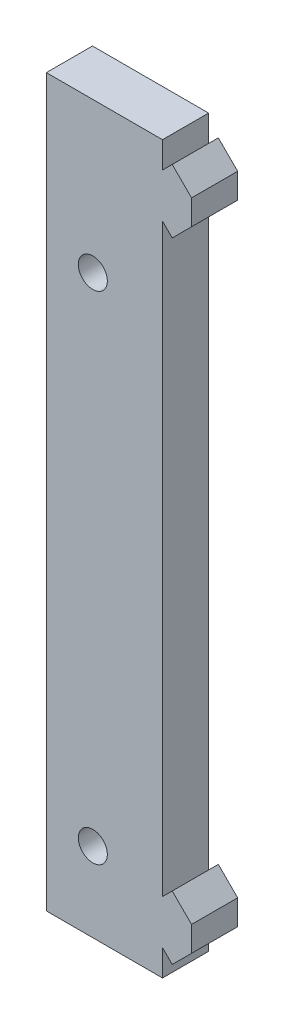
ISO-10303-21;
HEADER;
FILE_DESCRIPTION(('STEP AP214'),'2;1');
FILE_NAME('part.step','',(''),(''),'','','');
FILE_SCHEMA(('AUTOMOTIVE_DESIGN { 1 0 10303 214 1 1 1 1 }'));
ENDSEC;
DATA;
#1=APPLICATION_CONTEXT('core data for automotive mechanical design processes');
#2=APPLICATION_PROTOCOL_DEFINITION('international standard','automotive_design',2000,#1);
#3=PRODUCT_CONTEXT('',#1,'mechanical');
#4=PRODUCT('Part','Part','',(#3));
#5=PRODUCT_RELATED_PRODUCT_CATEGORY('part','',(#4));
#6=PRODUCT_DEFINITION_FORMATION('','',#4);
#7=PRODUCT_DEFINITION_CONTEXT('part definition',#1,'design');
#8=PRODUCT_DEFINITION('design','',#6,#7);
#9=PRODUCT_DEFINITION_SHAPE('','',#8);
#10=(LENGTH_UNIT() NAMED_UNIT(*) SI_UNIT(.MILLI.,.METRE.));
#11=(NAMED_UNIT(*) PLANE_ANGLE_UNIT() SI_UNIT($,.RADIAN.));
#12=(NAMED_UNIT(*) SI_UNIT($,.STERADIAN.) SOLID_ANGLE_UNIT());
#13=UNCERTAINTY_MEASURE_WITH_UNIT(LENGTH_MEASURE(1.E-05),#10,'distance_accuracy_value','');
#14=(GEOMETRIC_REPRESENTATION_CONTEXT(3) GLOBAL_UNCERTAINTY_ASSIGNED_CONTEXT((#13)) GLOBAL_UNIT_ASSIGNED_CONTEXT((#10,
#11,#12)) REPRESENTATION_CONTEXT('',''));
#15=CARTESIAN_POINT('',(0.,0.,0.));
#16=DIRECTION('',(0.,0.,1.));
#17=DIRECTION('',(1.,0.,0.));
#18=AXIS2_PLACEMENT_3D('',#15,#16,#17);
#19=CARTESIAN_POINT('',(0.,0.,4.7625));
#20=DIRECTION('',(0.,0.,-1.));
#21=DIRECTION('',(-1.,0.,0.));
#22=AXIS2_PLACEMENT_3D('',#19,#20,#21);
#23=PLANE('',#22);
#24=CARTESIAN_POINT('',(-7.2,-15.5,4.7625));
#25=DIRECTION('',(0.,0.,1.));
#26=DIRECTION('',(1.,0.,0.));
#27=AXIS2_PLACEMENT_3D('',#24,#25,#26);
#28=CIRCLE('',#27,1.5);
#29=CARTESIAN_POINT('',(-5.7,-15.5,4.7625));
#30=VERTEX_POINT('',#29);
#31=EDGE_CURVE('E180',#30,#30,#28,.T.);
#32=ORIENTED_EDGE('',*,*,#31,.F.);
#33=EDGE_LOOP('',(#32));
#34=FACE_BOUND('',#33,.T.);
#35=DIRECTION('',(0.,1.,0.));
#36=VECTOR('',#35,1.);
#37=CARTESIAN_POINT('',(0.,-2.71680015377856,4.7625));
#38=LINE('',#37,#36);
#39=CARTESIAN_POINT('',(0.,-2.71680015377856,4.7625));
#40=VERTEX_POINT('',#39);
#41=CARTESIAN_POINT('',(0.,0.,4.7625));
#42=VERTEX_POINT('',#41);
#43=EDGE_CURVE('E207',#40,#42,#38,.T.);
#44=ORIENTED_EDGE('',*,*,#43,.T.);
#45=DIRECTION('',(-1.,0.,0.));
#46=VECTOR('',#45,1.);
#47=CARTESIAN_POINT('',(-12.,0.,4.7625));
#48=LINE('',#47,#46);
#49=CARTESIAN_POINT('',(-12.,0.,4.7625));
#50=VERTEX_POINT('',#49);
#51=EDGE_CURVE('E115',#42,#50,#48,.T.);
#52=ORIENTED_EDGE('',*,*,#51,.T.);
#53=DIRECTION('',(0.,-1.,0.));
#54=VECTOR('',#53,1.);
#55=CARTESIAN_POINT('',(-12.,-75.,4.7625));
#56=LINE('',#55,#54);
#57=CARTESIAN_POINT('',(-12.,-75.,4.7625));
#58=VERTEX_POINT('',#57);
#59=EDGE_CURVE('E246',#50,#58,#56,.T.);
#60=ORIENTED_EDGE('',*,*,#59,.T.);
#61=DIRECTION('',(1.,0.,0.));
#62=VECTOR('',#61,1.);
#63=CARTESIAN_POINT('',(-12.,-75.,4.7625));
#64=LINE('',#63,#62);
#65=CARTESIAN_POINT('',(0.,-75.,4.7625));
#66=VERTEX_POINT('',#65);
#67=EDGE_CURVE('E265',#58,#66,#64,.T.);
#68=ORIENTED_EDGE('',*,*,#67,.T.);
#69=DIRECTION('',(0.,1.,0.));
#70=VECTOR('',#69,1.);
#71=CARTESIAN_POINT('',(0.,-75.,4.7625));
#72=LINE('',#71,#70);
#73=CARTESIAN_POINT('',(0.,-72.2831998462214,4.7625));
#74=VERTEX_POINT('',#73);
#75=EDGE_CURVE('E262',#66,#74,#72,.T.);
#76=ORIENTED_EDGE('',*,*,#75,.T.);
#77=DIRECTION('',(0.707106781186546,-0.707106781186549,0.));
#78=VECTOR('',#77,1.);
#79=CARTESIAN_POINT('',(0.,-72.2831998462214,4.7625));
#80=LINE('',#79,#78);
#81=CARTESIAN_POINT('',(1.00484668629601,-73.2880465325174,4.7625));
#82=VERTEX_POINT('',#81);
#83=EDGE_CURVE('E264',#74,#82,#80,.T.);
#84=ORIENTED_EDGE('',*,*,#83,.T.);
#85=DIRECTION('',(0.707106781186543,0.707106781186552,0.));
#86=VECTOR('',#85,1.);
#87=CARTESIAN_POINT('',(1.00484668629601,-73.2880465325174,4.7625));
#88=LINE('',#87,#86);
#89=CARTESIAN_POINT('',(2.99999999999997,-71.2928932188134,4.7625));
#90=VERTEX_POINT('',#89);
#91=EDGE_CURVE('E267',#82,#90,#88,.T.);
#92=ORIENTED_EDGE('',*,*,#91,.T.);
#93=DIRECTION('',(0.,1.,0.));
#94=VECTOR('',#93,1.);
#95=CARTESIAN_POINT('',(2.99999999999997,-71.2928932188134,4.7625));
#96=LINE('',#95,#94);
#97=CARTESIAN_POINT('',(2.99999999999997,-68.7071067811865,4.7625));
#98=VERTEX_POINT('',#97);
#99=EDGE_CURVE('E273',#90,#98,#96,.T.);
#100=ORIENTED_EDGE('',*,*,#99,.T.);
#101=DIRECTION('',(-0.707106781186548,0.707106781186547,0.));
#102=VECTOR('',#101,1.);
#103=CARTESIAN_POINT('',(2.99999999999997,-68.7071067811865,4.7625));
#104=LINE('',#103,#102);
#105=CARTESIAN_POINT('',(1.00484668629599,-66.7119534674826,4.7625));
#106=VERTEX_POINT('',#105);
#107=EDGE_CURVE('E275',#98,#106,#104,.T.);
#108=ORIENTED_EDGE('',*,*,#107,.T.);
#109=DIRECTION('',(-0.707106781186552,-0.707106781186543,0.));
#110=VECTOR('',#109,1.);
#111=CARTESIAN_POINT('',(1.00484668629599,-66.7119534674826,4.7625));
#112=LINE('',#111,#110);
#113=CARTESIAN_POINT('',(0.,-67.7168001537785,4.7625));
#114=VERTEX_POINT('',#113);
#115=EDGE_CURVE('E277',#106,#114,#112,.T.);
#116=ORIENTED_EDGE('',*,*,#115,.T.);
#117=DIRECTION('',(0.,1.,0.));
#118=VECTOR('',#117,1.);
#119=CARTESIAN_POINT('',(0.,-67.7168001537785,4.7625));
#120=LINE('',#119,#118);
#121=CARTESIAN_POINT('',(0.,-7.28319984622142,4.7625));
#122=VERTEX_POINT('',#121);
#123=EDGE_CURVE('E279',#114,#122,#120,.T.);
#124=ORIENTED_EDGE('',*,*,#123,.T.);
#125=DIRECTION('',(0.707106781186547,-0.707106781186548,0.));
#126=VECTOR('',#125,1.);
#127=CARTESIAN_POINT('',(1.00484668629602,-8.28804653251744,4.7625));
#128=LINE('',#127,#126);
#129=CARTESIAN_POINT('',(1.00484668629602,-8.28804653251744,4.7625));
#130=VERTEX_POINT('',#129);
#131=EDGE_CURVE('E281',#122,#130,#128,.T.);
#132=ORIENTED_EDGE('',*,*,#131,.T.);
#133=DIRECTION('',(0.707106781186547,0.707106781186548,0.));
#134=VECTOR('',#133,1.);
#135=CARTESIAN_POINT('',(3.00000000000001,-6.29289321881345,4.7625));
#136=LINE('',#135,#134);
#137=CARTESIAN_POINT('',(3.00000000000001,-6.29289321881345,4.7625));
#138=VERTEX_POINT('',#137);
#139=EDGE_CURVE('E158',#130,#138,#136,.T.);
#140=ORIENTED_EDGE('',*,*,#139,.T.);
#141=DIRECTION('',(0.,1.,0.));
#142=VECTOR('',#141,1.);
#143=CARTESIAN_POINT('',(3.00000000000001,-3.70710678118655,4.7625));
#144=LINE('',#143,#142);
#145=CARTESIAN_POINT('',(3.00000000000001,-3.70710678118655,4.7625));
#146=VERTEX_POINT('',#145);
#147=EDGE_CURVE('E152',#138,#146,#144,.T.);
#148=ORIENTED_EDGE('',*,*,#147,.T.);
#149=DIRECTION('',(-0.707106781186547,0.707106781186548,0.));
#150=VECTOR('',#149,1.);
#151=CARTESIAN_POINT('',(1.00484668629602,-1.71195346748255,4.7625));
#152=LINE('',#151,#150);
#153=CARTESIAN_POINT('',(1.00484668629602,-1.71195346748255,4.7625));
#154=VERTEX_POINT('',#153);
#155=EDGE_CURVE('E156',#146,#154,#152,.T.);
#156=ORIENTED_EDGE('',*,*,#155,.T.);
#157=DIRECTION('',(-0.70710678118655,-0.707106781186545,0.));
#158=VECTOR('',#157,1.);
#159=CARTESIAN_POINT('',(0.,-2.71680015377856,4.7625));
#160=LINE('',#159,#158);
#161=EDGE_CURVE('E48',#154,#40,#160,.T.);
#162=ORIENTED_EDGE('',*,*,#161,.T.);
#163=EDGE_LOOP('',(#44,#52,#60,#68,#76,#84,#92,#100,#108,#116,#124,#132,#140,#148,#156,#162));
#164=FACE_BOUND('',#163,.T.);
#165=CARTESIAN_POINT('',(-7.2,-66.8,4.7625));
#166=DIRECTION('',(0.,0.,1.));
#167=DIRECTION('',(1.,0.,0.));
#168=AXIS2_PLACEMENT_3D('',#165,#166,#167);
#169=CIRCLE('',#168,1.5);
#170=CARTESIAN_POINT('',(-5.7,-66.8,4.7625));
#171=VERTEX_POINT('',#170);
#172=EDGE_CURVE('E324',#171,#171,#169,.T.);
#173=ORIENTED_EDGE('',*,*,#172,.F.);
#174=EDGE_LOOP('',(#173));
#175=FACE_BOUND('',#174,.T.);
#176=ADVANCED_FACE('F31',(#34,#164,#175),#23,.F.);
#177=CARTESIAN_POINT('',(0.,0.,0.));
#178=DIRECTION('',(0.,0.,-1.));
#179=DIRECTION('',(-1.,0.,0.));
#180=AXIS2_PLACEMENT_3D('',#177,#178,#179);
#181=PLANE('',#180);
#182=CARTESIAN_POINT('',(-7.2,-15.5,0.));
#183=DIRECTION('',(0.,0.,1.));
#184=DIRECTION('',(1.,0.,0.));
#185=AXIS2_PLACEMENT_3D('',#182,#183,#184);
#186=CIRCLE('',#185,1.5);
#187=CARTESIAN_POINT('',(-5.7,-15.5,0.));
#188=VERTEX_POINT('',#187);
#189=EDGE_CURVE('E329',#188,#188,#186,.T.);
#190=ORIENTED_EDGE('',*,*,#189,.T.);
#191=EDGE_LOOP('',(#190));
#192=FACE_BOUND('',#191,.T.);
#193=DIRECTION('',(0.,1.,0.));
#194=VECTOR('',#193,1.);
#195=CARTESIAN_POINT('',(0.,-2.71680015377856,0.));
#196=LINE('',#195,#194);
#197=CARTESIAN_POINT('',(0.,-2.71680015377856,0.));
#198=VERTEX_POINT('',#197);
#199=CARTESIAN_POINT('',(0.,0.,0.));
#200=VERTEX_POINT('',#199);
#201=EDGE_CURVE('E176',#198,#200,#196,.T.);
#202=ORIENTED_EDGE('',*,*,#201,.F.);
#203=DIRECTION('',(-0.70710678118655,-0.707106781186545,0.));
#204=VECTOR('',#203,1.);
#205=CARTESIAN_POINT('',(0.,-2.71680015377856,0.));
#206=LINE('',#205,#204);
#207=CARTESIAN_POINT('',(1.00484668629602,-1.71195346748255,0.));
#208=VERTEX_POINT('',#207);
#209=EDGE_CURVE('E107',#208,#198,#206,.T.);
#210=ORIENTED_EDGE('',*,*,#209,.F.);
#211=DIRECTION('',(-0.707106781186547,0.707106781186548,0.));
#212=VECTOR('',#211,1.);
#213=CARTESIAN_POINT('',(1.00484668629602,-1.71195346748255,0.));
#214=LINE('',#213,#212);
#215=CARTESIAN_POINT('',(3.00000000000001,-3.70710678118655,0.));
#216=VERTEX_POINT('',#215);
#217=EDGE_CURVE('E101',#216,#208,#214,.T.);
#218=ORIENTED_EDGE('',*,*,#217,.F.);
#219=DIRECTION('',(0.,1.,0.));
#220=VECTOR('',#219,1.);
#221=CARTESIAN_POINT('',(3.00000000000001,-3.70710678118655,0.));
#222=LINE('',#221,#220);
#223=CARTESIAN_POINT('',(3.00000000000001,-6.29289321881345,0.));
#224=VERTEX_POINT('',#223);
#225=EDGE_CURVE('E166',#224,#216,#222,.T.);
#226=ORIENTED_EDGE('',*,*,#225,.F.);
#227=DIRECTION('',(0.707106781186547,0.707106781186548,0.));
#228=VECTOR('',#227,1.);
#229=CARTESIAN_POINT('',(3.00000000000001,-6.29289321881345,0.));
#230=LINE('',#229,#228);
#231=CARTESIAN_POINT('',(1.00484668629602,-8.28804653251744,0.));
#232=VERTEX_POINT('',#231);
#233=EDGE_CURVE('E202',#232,#224,#230,.T.);
#234=ORIENTED_EDGE('',*,*,#233,.F.);
#235=DIRECTION('',(0.707106781186547,-0.707106781186548,0.));
#236=VECTOR('',#235,1.);
#237=CARTESIAN_POINT('',(1.00484668629602,-8.28804653251744,0.));
#238=LINE('',#237,#236);
#239=CARTESIAN_POINT('',(0.,-7.28319984622142,0.));
#240=VERTEX_POINT('',#239);
#241=EDGE_CURVE('E200',#240,#232,#238,.T.);
#242=ORIENTED_EDGE('',*,*,#241,.F.);
#243=DIRECTION('',(0.,1.,0.));
#244=VECTOR('',#243,1.);
#245=CARTESIAN_POINT('',(0.,-67.7168001537785,0.));
#246=LINE('',#245,#244);
#247=CARTESIAN_POINT('',(0.,-67.7168001537785,0.));
#248=VERTEX_POINT('',#247);
#249=EDGE_CURVE('E198',#248,#240,#246,.T.);
#250=ORIENTED_EDGE('',*,*,#249,.F.);
#251=DIRECTION('',(-0.707106781186552,-0.707106781186543,0.));
#252=VECTOR('',#251,1.);
#253=CARTESIAN_POINT('',(1.00484668629599,-66.7119534674826,0.));
#254=LINE('',#253,#252);
#255=CARTESIAN_POINT('',(1.00484668629599,-66.7119534674826,0.));
#256=VERTEX_POINT('',#255);
#257=EDGE_CURVE('E196',#256,#248,#254,.T.);
#258=ORIENTED_EDGE('',*,*,#257,.F.);
#259=DIRECTION('',(-0.707106781186548,0.707106781186547,0.));
#260=VECTOR('',#259,1.);
#261=CARTESIAN_POINT('',(2.99999999999997,-68.7071067811865,0.));
#262=LINE('',#261,#260);
#263=CARTESIAN_POINT('',(2.99999999999997,-68.7071067811865,0.));
#264=VERTEX_POINT('',#263);
#265=EDGE_CURVE('E194',#264,#256,#262,.T.);
#266=ORIENTED_EDGE('',*,*,#265,.F.);
#267=DIRECTION('',(0.,1.,0.));
#268=VECTOR('',#267,1.);
#269=CARTESIAN_POINT('',(2.99999999999997,-71.2928932188134,0.));
#270=LINE('',#269,#268);
#271=CARTESIAN_POINT('',(2.99999999999997,-71.2928932188134,0.));
#272=VERTEX_POINT('',#271);
#273=EDGE_CURVE('E192',#272,#264,#270,.T.);
#274=ORIENTED_EDGE('',*,*,#273,.F.);
#275=DIRECTION('',(0.707106781186543,0.707106781186552,0.));
#276=VECTOR('',#275,1.);
#277=CARTESIAN_POINT('',(1.00484668629601,-73.2880465325174,0.));
#278=LINE('',#277,#276);
#279=CARTESIAN_POINT('',(1.00484668629601,-73.2880465325174,0.));
#280=VERTEX_POINT('',#279);
#281=EDGE_CURVE('E190',#280,#272,#278,.T.);
#282=ORIENTED_EDGE('',*,*,#281,.F.);
#283=DIRECTION('',(0.707106781186546,-0.707106781186549,0.));
#284=VECTOR('',#283,1.);
#285=CARTESIAN_POINT('',(0.,-72.2831998462214,0.));
#286=LINE('',#285,#284);
#287=CARTESIAN_POINT('',(0.,-72.2831998462214,0.));
#288=VERTEX_POINT('',#287);
#289=EDGE_CURVE('E188',#288,#280,#286,.T.);
#290=ORIENTED_EDGE('',*,*,#289,.F.);
#291=DIRECTION('',(0.,1.,0.));
#292=VECTOR('',#291,1.);
#293=CARTESIAN_POINT('',(0.,-75.,0.));
#294=LINE('',#293,#292);
#295=CARTESIAN_POINT('',(0.,-75.,0.));
#296=VERTEX_POINT('',#295);
#297=EDGE_CURVE('E186',#296,#288,#294,.T.);
#298=ORIENTED_EDGE('',*,*,#297,.F.);
#299=DIRECTION('',(1.,0.,0.));
#300=VECTOR('',#299,1.);
#301=CARTESIAN_POINT('',(-12.,-75.,0.));
#302=LINE('',#301,#300);
#303=CARTESIAN_POINT('',(-12.,-75.,0.));
#304=VERTEX_POINT('',#303);
#305=EDGE_CURVE('E184',#304,#296,#302,.T.);
#306=ORIENTED_EDGE('',*,*,#305,.F.);
#307=DIRECTION('',(0.,-1.,0.));
#308=VECTOR('',#307,1.);
#309=CARTESIAN_POINT('',(-12.,-75.,0.));
#310=LINE('',#309,#308);
#311=CARTESIAN_POINT('',(-12.,0.,0.));
#312=VERTEX_POINT('',#311);
#313=EDGE_CURVE('E182',#312,#304,#310,.T.);
#314=ORIENTED_EDGE('',*,*,#313,.F.);
#315=DIRECTION('',(-1.,0.,0.));
#316=VECTOR('',#315,1.);
#317=CARTESIAN_POINT('',(-12.,0.,0.));
#318=LINE('',#317,#316);
#319=EDGE_CURVE('E179',#200,#312,#318,.T.);
#320=ORIENTED_EDGE('',*,*,#319,.F.);
#321=EDGE_LOOP('',(#202,#210,#218,#226,#234,#242,#250,#258,#266,#274,#282,#290,#298,#306,#314,#320));
#322=FACE_BOUND('',#321,.T.);
#323=CARTESIAN_POINT('',(-7.2,-66.8,0.));
#324=DIRECTION('',(0.,0.,1.));
#325=DIRECTION('',(1.,0.,0.));
#326=AXIS2_PLACEMENT_3D('',#323,#324,#325);
#327=CIRCLE('',#326,1.5);
#328=CARTESIAN_POINT('',(-5.7,-66.8,0.));
#329=VERTEX_POINT('',#328);
#330=EDGE_CURVE('E327',#329,#329,#327,.T.);
#331=ORIENTED_EDGE('',*,*,#330,.T.);
#332=EDGE_LOOP('',(#331));
#333=FACE_BOUND('',#332,.T.);
#334=ADVANCED_FACE('F250',(#192,#322,#333),#181,.T.);
#335=CARTESIAN_POINT('',(0.,-2.71680015377856,4.7625));
#336=DIRECTION('',(-1.,0.,0.));
#337=DIRECTION('',(0.,0.,1.));
#338=AXIS2_PLACEMENT_3D('',#335,#336,#337);
#339=PLANE('',#338);
#340=ORIENTED_EDGE('',*,*,#201,.T.);
#341=DIRECTION('',(0.,0.,-1.));
#342=VECTOR('',#341,1.);
#343=CARTESIAN_POINT('',(0.,0.,4.7625));
#344=LINE('',#343,#342);
#345=EDGE_CURVE('E11',#42,#200,#344,.T.);
#346=ORIENTED_EDGE('',*,*,#345,.F.);
#347=ORIENTED_EDGE('',*,*,#43,.F.);
#348=DIRECTION('',(0.,0.,-1.));
#349=VECTOR('',#348,1.);
#350=CARTESIAN_POINT('',(0.,-2.71680015377856,4.7625));
#351=LINE('',#350,#349);
#352=EDGE_CURVE('E172',#40,#198,#351,.T.);
#353=ORIENTED_EDGE('',*,*,#352,.T.);
#354=EDGE_LOOP('',(#340,#346,#347,#353));
#355=FACE_BOUND('',#354,.T.);
#356=ADVANCED_FACE('F33',(#355),#339,.F.);
#357=CARTESIAN_POINT('',(-12.,0.,4.7625));
#358=DIRECTION('',(0.,-1.,0.));
#359=DIRECTION('',(0.,0.,-1.));
#360=AXIS2_PLACEMENT_3D('',#357,#358,#359);
#361=PLANE('',#360);
#362=ORIENTED_EDGE('',*,*,#319,.T.);
#363=DIRECTION('',(0.,0.,-1.));
#364=VECTOR('',#363,1.);
#365=CARTESIAN_POINT('',(-12.,0.,4.7625));
#366=LINE('',#365,#364);
#367=EDGE_CURVE('E40',#50,#312,#366,.T.);
#368=ORIENTED_EDGE('',*,*,#367,.F.);
#369=ORIENTED_EDGE('',*,*,#51,.F.);
#370=ORIENTED_EDGE('',*,*,#345,.T.);
#371=EDGE_LOOP('',(#362,#368,#369,#370));
#372=FACE_BOUND('',#371,.T.);
#373=ADVANCED_FACE('F462',(#372),#361,.F.);
#374=CARTESIAN_POINT('',(-12.,-75.,4.7625));
#375=DIRECTION('',(1.,0.,0.));
#376=DIRECTION('',(0.,0.,-1.));
#377=AXIS2_PLACEMENT_3D('',#374,#375,#376);
#378=PLANE('',#377);
#379=ORIENTED_EDGE('',*,*,#313,.T.);
#380=DIRECTION('',(0.,0.,-1.));
#381=VECTOR('',#380,1.);
#382=CARTESIAN_POINT('',(-12.,-75.,4.7625));
#383=LINE('',#382,#381);
#384=EDGE_CURVE('E238',#58,#304,#383,.T.);
#385=ORIENTED_EDGE('',*,*,#384,.F.);
#386=ORIENTED_EDGE('',*,*,#59,.F.);
#387=ORIENTED_EDGE('',*,*,#367,.T.);
#388=EDGE_LOOP('',(#379,#385,#386,#387));
#389=FACE_BOUND('',#388,.T.);
#390=ADVANCED_FACE('F244',(#389),#378,.F.);
#391=CARTESIAN_POINT('',(-12.,-75.,4.7625));
#392=DIRECTION('',(0.,1.,0.));
#393=DIRECTION('',(0.,0.,1.));
#394=AXIS2_PLACEMENT_3D('',#391,#392,#393);
#395=PLANE('',#394);
#396=ORIENTED_EDGE('',*,*,#305,.T.);
#397=DIRECTION('',(0.,0.,-1.));
#398=VECTOR('',#397,1.);
#399=CARTESIAN_POINT('',(0.,-75.,4.7625));
#400=LINE('',#399,#398);
#401=EDGE_CURVE('E235',#66,#296,#400,.T.);
#402=ORIENTED_EDGE('',*,*,#401,.F.);
#403=ORIENTED_EDGE('',*,*,#67,.F.);
#404=ORIENTED_EDGE('',*,*,#384,.T.);
#405=EDGE_LOOP('',(#396,#402,#403,#404));
#406=FACE_BOUND('',#405,.T.);
#407=ADVANCED_FACE('F256',(#406),#395,.F.);
#408=CARTESIAN_POINT('',(0.,-75.,4.7625));
#409=DIRECTION('',(-1.,0.,0.));
#410=DIRECTION('',(0.,-1.,0.));
#411=AXIS2_PLACEMENT_3D('',#408,#409,#410);
#412=PLANE('',#411);
#413=ORIENTED_EDGE('',*,*,#297,.T.);
#414=DIRECTION('',(0.,0.,-1.));
#415=VECTOR('',#414,1.);
#416=CARTESIAN_POINT('',(0.,-72.2831998462214,4.7625));
#417=LINE('',#416,#415);
#418=EDGE_CURVE('E232',#74,#288,#417,.T.);
#419=ORIENTED_EDGE('',*,*,#418,.F.);
#420=ORIENTED_EDGE('',*,*,#75,.F.);
#421=ORIENTED_EDGE('',*,*,#401,.T.);
#422=EDGE_LOOP('',(#413,#419,#420,#421));
#423=FACE_BOUND('',#422,.T.);
#424=ADVANCED_FACE('F260',(#423),#412,.F.);
#425=CARTESIAN_POINT('',(0.,-72.2831998462214,4.7625));
#426=DIRECTION('',(0.707106781186549,0.707106781186546,0.));
#427=DIRECTION('',(-0.707106781186546,0.707106781186549,0.));
#428=AXIS2_PLACEMENT_3D('',#425,#426,#427);
#429=PLANE('',#428);
#430=ORIENTED_EDGE('',*,*,#289,.T.);
#431=DIRECTION('',(0.,0.,-1.));
#432=VECTOR('',#431,1.);
#433=CARTESIAN_POINT('',(1.00484668629601,-73.2880465325174,4.7625));
#434=LINE('',#433,#432);
#435=EDGE_CURVE('E229',#82,#280,#434,.T.);
#436=ORIENTED_EDGE('',*,*,#435,.F.);
#437=ORIENTED_EDGE('',*,*,#83,.F.);
#438=ORIENTED_EDGE('',*,*,#418,.T.);
#439=EDGE_LOOP('',(#430,#436,#437,#438));
#440=FACE_BOUND('',#439,.T.);
#441=ADVANCED_FACE('F427',(#440),#429,.F.);
#442=CARTESIAN_POINT('',(1.00484668629601,-73.2880465325174,4.7625));
#443=DIRECTION('',(-0.707106781186552,0.707106781186543,0.));
#444=DIRECTION('',(-0.707106781186543,-0.707106781186552,0.));
#445=AXIS2_PLACEMENT_3D('',#442,#443,#444);
#446=PLANE('',#445);
#447=ORIENTED_EDGE('',*,*,#281,.T.);
#448=DIRECTION('',(0.,0.,-1.));
#449=VECTOR('',#448,1.);
#450=CARTESIAN_POINT('',(2.99999999999997,-71.2928932188134,4.7625));
#451=LINE('',#450,#449);
#452=EDGE_CURVE('E226',#90,#272,#451,.T.);
#453=ORIENTED_EDGE('',*,*,#452,.F.);
#454=ORIENTED_EDGE('',*,*,#91,.F.);
#455=ORIENTED_EDGE('',*,*,#435,.T.);
#456=EDGE_LOOP('',(#447,#453,#454,#455));
#457=FACE_BOUND('',#456,.T.);
#458=ADVANCED_FACE('F417',(#457),#446,.F.);
#459=CARTESIAN_POINT('',(2.99999999999997,-71.2928932188134,4.7625));
#460=DIRECTION('',(-1.,0.,0.));
#461=DIRECTION('',(0.,-1.,0.));
#462=AXIS2_PLACEMENT_3D('',#459,#460,#461);
#463=PLANE('',#462);
#464=ORIENTED_EDGE('',*,*,#273,.T.);
#465=DIRECTION('',(0.,0.,-1.));
#466=VECTOR('',#465,1.);
#467=CARTESIAN_POINT('',(2.99999999999997,-68.7071067811865,4.7625));
#468=LINE('',#467,#466);
#469=EDGE_CURVE('E223',#98,#264,#468,.T.);
#470=ORIENTED_EDGE('',*,*,#469,.F.);
#471=ORIENTED_EDGE('',*,*,#99,.F.);
#472=ORIENTED_EDGE('',*,*,#452,.T.);
#473=EDGE_LOOP('',(#464,#470,#471,#472));
#474=FACE_BOUND('',#473,.T.);
#475=ADVANCED_FACE('F407',(#474),#463,.F.);
#476=CARTESIAN_POINT('',(2.99999999999997,-68.7071067811865,4.7625));
#477=DIRECTION('',(-0.707106781186547,-0.707106781186548,0.));
#478=DIRECTION('',(0.707106781186548,-0.707106781186547,0.));
#479=AXIS2_PLACEMENT_3D('',#476,#477,#478);
#480=PLANE('',#479);
#481=ORIENTED_EDGE('',*,*,#265,.T.);
#482=DIRECTION('',(0.,0.,-1.));
#483=VECTOR('',#482,1.);
#484=CARTESIAN_POINT('',(1.00484668629599,-66.7119534674826,4.7625));
#485=LINE('',#484,#483);
#486=EDGE_CURVE('E220',#106,#256,#485,.T.);
#487=ORIENTED_EDGE('',*,*,#486,.F.);
#488=ORIENTED_EDGE('',*,*,#107,.F.);
#489=ORIENTED_EDGE('',*,*,#469,.T.);
#490=EDGE_LOOP('',(#481,#487,#488,#489));
#491=FACE_BOUND('',#490,.T.);
#492=ADVANCED_FACE('F397',(#491),#480,.F.);
#493=CARTESIAN_POINT('',(1.00484668629599,-66.7119534674826,4.7625));
#494=DIRECTION('',(0.707106781186543,-0.707106781186552,0.));
#495=DIRECTION('',(0.707106781186552,0.707106781186543,0.));
#496=AXIS2_PLACEMENT_3D('',#493,#494,#495);
#497=PLANE('',#496);
#498=ORIENTED_EDGE('',*,*,#257,.T.);
#499=DIRECTION('',(0.,0.,-1.));
#500=VECTOR('',#499,1.);
#501=CARTESIAN_POINT('',(0.,-67.7168001537785,4.7625));
#502=LINE('',#501,#500);
#503=EDGE_CURVE('E217',#114,#248,#502,.T.);
#504=ORIENTED_EDGE('',*,*,#503,.F.);
#505=ORIENTED_EDGE('',*,*,#115,.F.);
#506=ORIENTED_EDGE('',*,*,#486,.T.);
#507=EDGE_LOOP('',(#498,#504,#505,#506));
#508=FACE_BOUND('',#507,.T.);
#509=ADVANCED_FACE('F387',(#508),#497,.F.);
#510=CARTESIAN_POINT('',(0.,-67.7168001537785,4.7625));
#511=DIRECTION('',(-1.,0.,0.));
#512=DIRECTION('',(0.,-1.,0.));
#513=AXIS2_PLACEMENT_3D('',#510,#511,#512);
#514=PLANE('',#513);
#515=ORIENTED_EDGE('',*,*,#249,.T.);
#516=DIRECTION('',(0.,0.,-1.));
#517=VECTOR('',#516,1.);
#518=CARTESIAN_POINT('',(0.,-7.28319984622142,4.7625));
#519=LINE('',#518,#517);
#520=EDGE_CURVE('E214',#122,#240,#519,.T.);
#521=ORIENTED_EDGE('',*,*,#520,.F.);
#522=ORIENTED_EDGE('',*,*,#123,.F.);
#523=ORIENTED_EDGE('',*,*,#503,.T.);
#524=EDGE_LOOP('',(#515,#521,#522,#523));
#525=FACE_BOUND('',#524,.T.);
#526=ADVANCED_FACE('F378',(#525),#514,.F.);
#527=CARTESIAN_POINT('',(1.00484668629602,-8.28804653251744,4.7625));
#528=DIRECTION('',(0.707106781186548,0.707106781186547,0.));
#529=DIRECTION('',(-0.707106781186547,0.707106781186548,0.));
#530=AXIS2_PLACEMENT_3D('',#527,#528,#529);
#531=PLANE('',#530);
#532=ORIENTED_EDGE('',*,*,#241,.T.);
#533=DIRECTION('',(0.,0.,-1.));
#534=VECTOR('',#533,1.);
#535=CARTESIAN_POINT('',(1.00484668629602,-8.28804653251744,4.7625));
#536=LINE('',#535,#534);
#537=EDGE_CURVE('E211',#130,#232,#536,.T.);
#538=ORIENTED_EDGE('',*,*,#537,.F.);
#539=ORIENTED_EDGE('',*,*,#131,.F.);
#540=ORIENTED_EDGE('',*,*,#520,.T.);
#541=EDGE_LOOP('',(#532,#538,#539,#540));
#542=FACE_BOUND('',#541,.T.);
#543=ADVANCED_FACE('F287',(#542),#531,.F.);
#544=CARTESIAN_POINT('',(3.00000000000001,-6.29289321881345,4.7625));
#545=DIRECTION('',(-0.707106781186548,0.707106781186547,0.));
#546=DIRECTION('',(-0.707106781186547,-0.707106781186548,0.));
#547=AXIS2_PLACEMENT_3D('',#544,#545,#546);
#548=PLANE('',#547);
#549=ORIENTED_EDGE('',*,*,#233,.T.);
#550=DIRECTION('',(0.,0.,-1.));
#551=VECTOR('',#550,1.);
#552=CARTESIAN_POINT('',(3.00000000000001,-6.29289321881345,4.7625));
#553=LINE('',#552,#551);
#554=EDGE_CURVE('E167',#138,#224,#553,.T.);
#555=ORIENTED_EDGE('',*,*,#554,.F.);
#556=ORIENTED_EDGE('',*,*,#139,.F.);
#557=ORIENTED_EDGE('',*,*,#537,.T.);
#558=EDGE_LOOP('',(#549,#555,#556,#557));
#559=FACE_BOUND('',#558,.T.);
#560=ADVANCED_FACE('F291',(#559),#548,.F.);
#561=CARTESIAN_POINT('',(3.00000000000001,-3.70710678118655,4.7625));
#562=DIRECTION('',(-1.,0.,0.));
#563=DIRECTION('',(0.,0.,1.));
#564=AXIS2_PLACEMENT_3D('',#561,#562,#563);
#565=PLANE('',#564);
#566=ORIENTED_EDGE('',*,*,#225,.T.);
#567=DIRECTION('',(0.,0.,-1.));
#568=VECTOR('',#567,1.);
#569=CARTESIAN_POINT('',(3.00000000000001,-3.70710678118655,4.7625));
#570=LINE('',#569,#568);
#571=EDGE_CURVE('E163',#146,#216,#570,.T.);
#572=ORIENTED_EDGE('',*,*,#571,.F.);
#573=ORIENTED_EDGE('',*,*,#147,.F.);
#574=ORIENTED_EDGE('',*,*,#554,.T.);
#575=EDGE_LOOP('',(#566,#572,#573,#574));
#576=FACE_BOUND('',#575,.T.);
#577=ADVANCED_FACE('F164',(#576),#565,.F.);
#578=CARTESIAN_POINT('',(1.00484668629602,-1.71195346748255,4.7625));
#579=DIRECTION('',(-0.707106781186548,-0.707106781186547,0.));
#580=DIRECTION('',(0.707106781186547,-0.707106781186548,0.));
#581=AXIS2_PLACEMENT_3D('',#578,#579,#580);
#582=PLANE('',#581);
#583=ORIENTED_EDGE('',*,*,#217,.T.);
#584=DIRECTION('',(0.,0.,-1.));
#585=VECTOR('',#584,1.);
#586=CARTESIAN_POINT('',(1.00484668629602,-1.71195346748255,4.7625));
#587=LINE('',#586,#585);
#588=EDGE_CURVE('E168',#154,#208,#587,.T.);
#589=ORIENTED_EDGE('',*,*,#588,.F.);
#590=ORIENTED_EDGE('',*,*,#155,.F.);
#591=ORIENTED_EDGE('',*,*,#571,.T.);
#592=EDGE_LOOP('',(#583,#589,#590,#591));
#593=FACE_BOUND('',#592,.T.);
#594=ADVANCED_FACE('F170',(#593),#582,.F.);
#595=CARTESIAN_POINT('',(0.,-2.71680015377856,4.7625));
#596=DIRECTION('',(0.707106781186545,-0.70710678118655,0.));
#597=DIRECTION('',(0.70710678118655,0.707106781186545,0.));
#598=AXIS2_PLACEMENT_3D('',#595,#596,#597);
#599=PLANE('',#598);
#600=ORIENTED_EDGE('',*,*,#209,.T.);
#601=ORIENTED_EDGE('',*,*,#352,.F.);
#602=ORIENTED_EDGE('',*,*,#161,.F.);
#603=ORIENTED_EDGE('',*,*,#588,.T.);
#604=EDGE_LOOP('',(#600,#601,#602,#603));
#605=FACE_BOUND('',#604,.T.);
#606=ADVANCED_FACE('F295',(#605),#599,.F.);
#607=CARTESIAN_POINT('',(-7.2,-15.5,4.7625));
#608=DIRECTION('',(0.,0.,-1.));
#609=DIRECTION('',(-1.,0.,0.));
#610=AXIS2_PLACEMENT_3D('',#607,#608,#609);
#611=CYLINDRICAL_SURFACE('',#610,1.5);
#612=ORIENTED_EDGE('',*,*,#31,.T.);
#613=EDGE_LOOP('',(#612));
#614=FACE_BOUND('',#613,.T.);
#615=ORIENTED_EDGE('',*,*,#189,.F.);
#616=EDGE_LOOP('',(#615));
#617=FACE_BOUND('',#616,.T.);
#618=ADVANCED_FACE('F297',(#614,#617),#611,.F.);
#619=CARTESIAN_POINT('',(-7.2,-66.8,4.7625));
#620=DIRECTION('',(0.,0.,-1.));
#621=DIRECTION('',(-1.,0.,0.));
#622=AXIS2_PLACEMENT_3D('',#619,#620,#621);
#623=CYLINDRICAL_SURFACE('',#622,1.5);
#624=ORIENTED_EDGE('',*,*,#172,.T.);
#625=EDGE_LOOP('',(#624));
#626=FACE_BOUND('',#625,.T.);
#627=ORIENTED_EDGE('',*,*,#330,.F.);
#628=EDGE_LOOP('',(#627));
#629=FACE_BOUND('',#628,.T.);
#630=ADVANCED_FACE('F303',(#626,#629),#623,.F.);
#631=CLOSED_SHELL('',(#176,#334,#356,#373,#390,#407,#424,#441,#458,#475,#492,#509,#526,#543,
#560,#577,#594,#606,#618,#630));
#632=MANIFOLD_SOLID_BREP('B2',#631);
#633=ADVANCED_BREP_SHAPE_REPRESENTATION('',(#18,#632),#14);
#634=SHAPE_DEFINITION_REPRESENTATION(#9,#633);
ENDSEC;
END-ISO-10303-21;
